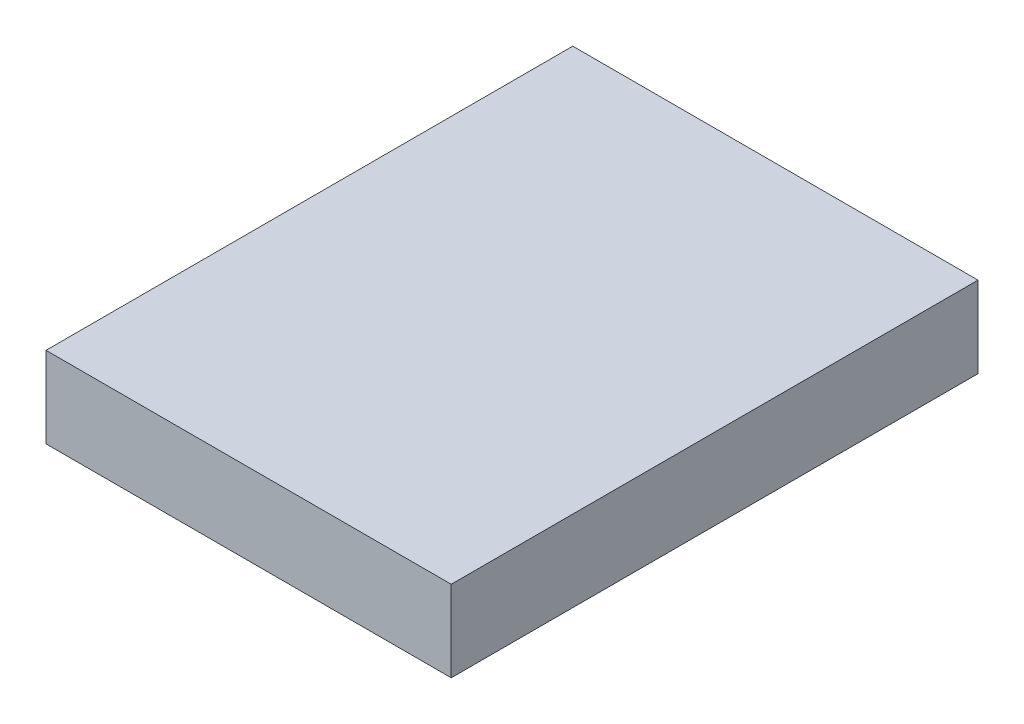
ISO-10303-21;
HEADER;
FILE_DESCRIPTION(('STEP AP214'),'2;1');
FILE_NAME('part.step','',(''),(''),'','','');
FILE_SCHEMA(('AUTOMOTIVE_DESIGN { 1 0 10303 214 1 1 1 1 }'));
ENDSEC;
DATA;
#1=APPLICATION_CONTEXT('core data for automotive mechanical design processes');
#2=APPLICATION_PROTOCOL_DEFINITION('international standard','automotive_design',2000,#1);
#3=PRODUCT_CONTEXT('',#1,'mechanical');
#4=PRODUCT('Part','Part','',(#3));
#5=PRODUCT_RELATED_PRODUCT_CATEGORY('part','',(#4));
#6=PRODUCT_DEFINITION_FORMATION('','',#4);
#7=PRODUCT_DEFINITION_CONTEXT('part definition',#1,'design');
#8=PRODUCT_DEFINITION('design','',#6,#7);
#9=PRODUCT_DEFINITION_SHAPE('','',#8);
#10=(LENGTH_UNIT() NAMED_UNIT(*) SI_UNIT(.MILLI.,.METRE.));
#11=(NAMED_UNIT(*) PLANE_ANGLE_UNIT() SI_UNIT($,.RADIAN.));
#12=(NAMED_UNIT(*) SI_UNIT($,.STERADIAN.) SOLID_ANGLE_UNIT());
#13=UNCERTAINTY_MEASURE_WITH_UNIT(LENGTH_MEASURE(1.E-05),#10,'distance_accuracy_value','');
#14=(GEOMETRIC_REPRESENTATION_CONTEXT(3) GLOBAL_UNCERTAINTY_ASSIGNED_CONTEXT((#13)) GLOBAL_UNIT_ASSIGNED_CONTEXT((#10,
#11,#12)) REPRESENTATION_CONTEXT('',''));
#15=CARTESIAN_POINT('',(0.,0.,0.));
#16=DIRECTION('',(0.,0.,1.));
#17=DIRECTION('',(1.,0.,0.));
#18=AXIS2_PLACEMENT_3D('',#15,#16,#17);
#19=CARTESIAN_POINT('',(0.,0.2,0.));
#20=DIRECTION('',(0.,1.,0.));
#21=DIRECTION('',(-1.,0.,0.));
#22=AXIS2_PLACEMENT_3D('',#19,#20,#21);
#23=PLANE('',#22);
#24=DIRECTION('',(0.,0.,-1.));
#25=VECTOR('',#24,1.);
#26=CARTESIAN_POINT('',(-1.54999999999997,0.199999999999985,4.25000000000001));
#27=LINE('',#26,#25);
#28=CARTESIAN_POINT('',(-1.54999999999997,0.199999999999985,4.25000000000001));
#29=VERTEX_POINT('',#28);
#30=CARTESIAN_POINT('',(-1.54999999999997,0.199999999999989,2.95000000000001));
#31=VERTEX_POINT('',#30);
#32=EDGE_CURVE('E11',#29,#31,#27,.T.);
#33=ORIENTED_EDGE('',*,*,#32,.F.);
#34=DIRECTION('',(-1.,0.,0.));
#35=VECTOR('',#34,1.);
#36=CARTESIAN_POINT('',(-1.54999999999997,0.199999999999985,4.25000000000001));
#37=LINE('',#36,#35);
#38=CARTESIAN_POINT('',(-0.549999999999976,0.199999999999985,4.25000000000003));
#39=VERTEX_POINT('',#38);
#40=EDGE_CURVE('E24',#39,#29,#37,.T.);
#41=ORIENTED_EDGE('',*,*,#40,.F.);
#42=DIRECTION('',(0.,0.,1.));
#43=VECTOR('',#42,1.);
#44=CARTESIAN_POINT('',(-0.549999999999976,0.199999999999985,4.25000000000001));
#45=LINE('',#44,#43);
#46=CARTESIAN_POINT('',(-0.549999999999976,0.199999999999989,2.95000000000001));
#47=VERTEX_POINT('',#46);
#48=EDGE_CURVE('E75',#47,#39,#45,.T.);
#49=ORIENTED_EDGE('',*,*,#48,.F.);
#50=DIRECTION('',(1.,0.,0.));
#51=VECTOR('',#50,1.);
#52=CARTESIAN_POINT('',(-1.54999999999997,0.199999999999989,2.95000000000001));
#53=LINE('',#52,#51);
#54=EDGE_CURVE('E85',#31,#47,#53,.T.);
#55=ORIENTED_EDGE('',*,*,#54,.F.);
#56=EDGE_LOOP('',(#33,#41,#49,#55));
#57=FACE_BOUND('',#56,.T.);
#58=ADVANCED_FACE('F17',(#57),#23,.T.);
#59=CARTESIAN_POINT('',(0.,0.,0.));
#60=DIRECTION('',(0.,-1.,0.));
#61=DIRECTION('',(0.,0.,-1.));
#62=AXIS2_PLACEMENT_3D('',#59,#60,#61);
#63=PLANE('',#62);
#64=DIRECTION('',(0.,0.,-1.));
#65=VECTOR('',#64,1.);
#66=CARTESIAN_POINT('',(-1.54999999999997,0.,4.25000000000001));
#67=LINE('',#66,#65);
#68=CARTESIAN_POINT('',(-1.54999999999997,0.,4.25000000000001));
#69=VERTEX_POINT('',#68);
#70=CARTESIAN_POINT('',(-1.54999999999997,0.,2.95000000000001));
#71=VERTEX_POINT('',#70);
#72=EDGE_CURVE('E83',#69,#71,#67,.T.);
#73=ORIENTED_EDGE('',*,*,#72,.T.);
#74=DIRECTION('',(1.,0.,0.));
#75=VECTOR('',#74,1.);
#76=CARTESIAN_POINT('',(-1.54999999999997,0.,2.95000000000001));
#77=LINE('',#76,#75);
#78=CARTESIAN_POINT('',(-0.549999999999976,0.,2.95000000000001));
#79=VERTEX_POINT('',#78);
#80=EDGE_CURVE('E60',#71,#79,#77,.T.);
#81=ORIENTED_EDGE('',*,*,#80,.T.);
#82=DIRECTION('',(0.,0.,1.));
#83=VECTOR('',#82,1.);
#84=CARTESIAN_POINT('',(-0.549999999999976,0.,4.25000000000001));
#85=LINE('',#84,#83);
#86=CARTESIAN_POINT('',(-0.549999999999976,0.,4.25000000000001));
#87=VERTEX_POINT('',#86);
#88=EDGE_CURVE('E54',#79,#87,#85,.T.);
#89=ORIENTED_EDGE('',*,*,#88,.T.);
#90=DIRECTION('',(-1.,0.,0.));
#91=VECTOR('',#90,1.);
#92=CARTESIAN_POINT('',(-1.54999999999997,0.,4.25000000000001));
#93=LINE('',#92,#91);
#94=EDGE_CURVE('E57',#87,#69,#93,.T.);
#95=ORIENTED_EDGE('',*,*,#94,.T.);
#96=EDGE_LOOP('',(#73,#81,#89,#95));
#97=FACE_BOUND('',#96,.T.);
#98=ADVANCED_FACE('F56',(#97),#63,.T.);
#99=CARTESIAN_POINT('',(-1.54999999999997,4.22492235949961,2.95000000000002));
#100=DIRECTION('',(0.,0.,-1.));
#101=DIRECTION('',(0.,1.,0.));
#102=AXIS2_PLACEMENT_3D('',#99,#100,#101);
#103=PLANE('',#102);
#104=DIRECTION('',(0.,-1.,0.));
#105=VECTOR('',#104,1.);
#106=CARTESIAN_POINT('',(-1.54999999999997,4.22492235949961,2.95000000000002));
#107=LINE('',#106,#105);
#108=EDGE_CURVE('E71',#31,#71,#107,.T.);
#109=ORIENTED_EDGE('',*,*,#108,.F.);
#110=ORIENTED_EDGE('',*,*,#54,.T.);
#111=DIRECTION('',(0.,-1.,0.));
#112=VECTOR('',#111,1.);
#113=CARTESIAN_POINT('',(-0.549999999999976,4.22492235949961,2.95000000000002));
#114=LINE('',#113,#112);
#115=EDGE_CURVE('E76',#47,#79,#114,.T.);
#116=ORIENTED_EDGE('',*,*,#115,.T.);
#117=ORIENTED_EDGE('',*,*,#80,.F.);
#118=EDGE_LOOP('',(#109,#110,#116,#117));
#119=FACE_BOUND('',#118,.T.);
#120=ADVANCED_FACE('F91',(#119),#103,.T.);
#121=CARTESIAN_POINT('',(-0.549999999999976,4.22492235949961,4.25000000000003));
#122=DIRECTION('',(1.,0.,0.));
#123=DIRECTION('',(0.,1.,0.));
#124=AXIS2_PLACEMENT_3D('',#121,#122,#123);
#125=PLANE('',#124);
#126=ORIENTED_EDGE('',*,*,#115,.F.);
#127=ORIENTED_EDGE('',*,*,#48,.T.);
#128=DIRECTION('',(0.,-1.,0.));
#129=VECTOR('',#128,1.);
#130=CARTESIAN_POINT('',(-0.549999999999976,4.22492235949961,4.25000000000003));
#131=LINE('',#130,#129);
#132=EDGE_CURVE('E69',#39,#87,#131,.T.);
#133=ORIENTED_EDGE('',*,*,#132,.T.);
#134=ORIENTED_EDGE('',*,*,#88,.F.);
#135=EDGE_LOOP('',(#126,#127,#133,#134));
#136=FACE_BOUND('',#135,.T.);
#137=ADVANCED_FACE('F74',(#136),#125,.T.);
#138=CARTESIAN_POINT('',(-1.54999999999997,4.22492235949961,4.25000000000003));
#139=DIRECTION('',(0.,0.,1.));
#140=DIRECTION('',(0.,-1.,0.));
#141=AXIS2_PLACEMENT_3D('',#138,#139,#140);
#142=PLANE('',#141);
#143=ORIENTED_EDGE('',*,*,#132,.F.);
#144=ORIENTED_EDGE('',*,*,#40,.T.);
#145=DIRECTION('',(0.,-1.,0.));
#146=VECTOR('',#145,1.);
#147=CARTESIAN_POINT('',(-1.54999999999997,4.22492235949961,4.25000000000003));
#148=LINE('',#147,#146);
#149=EDGE_CURVE('E70',#29,#69,#148,.T.);
#150=ORIENTED_EDGE('',*,*,#149,.T.);
#151=ORIENTED_EDGE('',*,*,#94,.F.);
#152=EDGE_LOOP('',(#143,#144,#150,#151));
#153=FACE_BOUND('',#152,.T.);
#154=ADVANCED_FACE('F68',(#153),#142,.T.);
#155=CARTESIAN_POINT('',(-1.54999999999997,4.22492235949961,4.25000000000003));
#156=DIRECTION('',(-1.,0.,0.));
#157=DIRECTION('',(0.,-1.,0.));
#158=AXIS2_PLACEMENT_3D('',#155,#156,#157);
#159=PLANE('',#158);
#160=ORIENTED_EDGE('',*,*,#149,.F.);
#161=ORIENTED_EDGE('',*,*,#32,.T.);
#162=ORIENTED_EDGE('',*,*,#108,.T.);
#163=ORIENTED_EDGE('',*,*,#72,.F.);
#164=EDGE_LOOP('',(#160,#161,#162,#163));
#165=FACE_BOUND('',#164,.T.);
#166=ADVANCED_FACE('F88',(#165),#159,.T.);
#167=CLOSED_SHELL('',(#58,#98,#120,#137,#154,#166));
#168=MANIFOLD_SOLID_BREP('B1',#167);
#169=ADVANCED_BREP_SHAPE_REPRESENTATION('',(#18,#168),#14);
#170=SHAPE_DEFINITION_REPRESENTATION(#9,#169);
ENDSEC;
END-ISO-10303-21;
